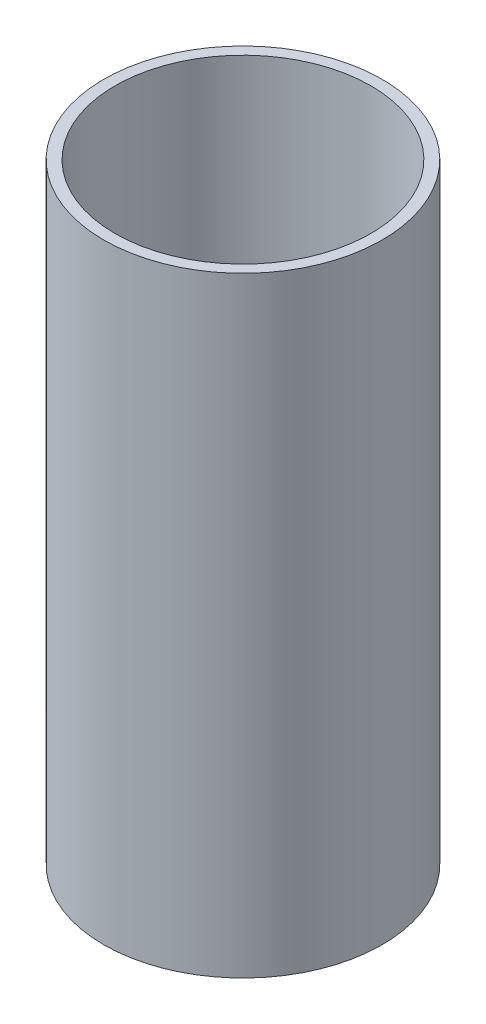
ISO-10303-21;
HEADER;
FILE_DESCRIPTION(('STEP AP214'),'2;1');
FILE_NAME('part.step','',(''),(''),'','','');
FILE_SCHEMA(('AUTOMOTIVE_DESIGN { 1 0 10303 214 1 1 1 1 }'));
ENDSEC;
DATA;
#1=APPLICATION_CONTEXT('core data for automotive mechanical design processes');
#2=APPLICATION_PROTOCOL_DEFINITION('international standard','automotive_design',2000,#1);
#3=PRODUCT_CONTEXT('',#1,'mechanical');
#4=PRODUCT('Part','Part','',(#3));
#5=PRODUCT_RELATED_PRODUCT_CATEGORY('part','',(#4));
#6=PRODUCT_DEFINITION_FORMATION('','',#4);
#7=PRODUCT_DEFINITION_CONTEXT('part definition',#1,'design');
#8=PRODUCT_DEFINITION('design','',#6,#7);
#9=PRODUCT_DEFINITION_SHAPE('','',#8);
#10=(LENGTH_UNIT() NAMED_UNIT(*) SI_UNIT(.MILLI.,.METRE.));
#11=(NAMED_UNIT(*) PLANE_ANGLE_UNIT() SI_UNIT($,.RADIAN.));
#12=(NAMED_UNIT(*) SI_UNIT($,.STERADIAN.) SOLID_ANGLE_UNIT());
#13=UNCERTAINTY_MEASURE_WITH_UNIT(LENGTH_MEASURE(1.E-05),#10,'distance_accuracy_value','');
#14=(GEOMETRIC_REPRESENTATION_CONTEXT(3) GLOBAL_UNCERTAINTY_ASSIGNED_CONTEXT((#13)) GLOBAL_UNIT_ASSIGNED_CONTEXT((#10,
#11,#12)) REPRESENTATION_CONTEXT('',''));
#15=CARTESIAN_POINT('',(0.,0.,0.));
#16=DIRECTION('',(0.,0.,1.));
#17=DIRECTION('',(1.,0.,0.));
#18=AXIS2_PLACEMENT_3D('',#15,#16,#17);
#19=CARTESIAN_POINT('',(-26.,30.2199119985306,0.));
#20=DIRECTION('',(0.,1.,0.));
#21=DIRECTION('',(0.,0.,1.));
#22=AXIS2_PLACEMENT_3D('',#19,#20,#21);
#23=PLANE('',#22);
#24=CARTESIAN_POINT('',(0.,30.2199119985306,0.));
#25=DIRECTION('',(0.,1.,0.));
#26=DIRECTION('',(0.,0.,1.));
#27=AXIS2_PLACEMENT_3D('',#24,#25,#26);
#28=CIRCLE('',#27,26.);
#29=CARTESIAN_POINT('',(0.,30.2199119985306,26.));
#30=VERTEX_POINT('',#29);
#31=EDGE_CURVE('E51',#30,#30,#28,.T.);
#32=ORIENTED_EDGE('',*,*,#31,.T.);
#33=EDGE_LOOP('',(#32));
#34=FACE_BOUND('',#33,.T.);
#35=CARTESIAN_POINT('',(0.,30.2199119985306,0.));
#36=DIRECTION('',(0.,1.,0.));
#37=DIRECTION('',(0.,0.,1.));
#38=AXIS2_PLACEMENT_3D('',#35,#36,#37);
#39=CIRCLE('',#38,23.9);
#40=CARTESIAN_POINT('',(0.,30.2199119985306,23.9));
#41=VERTEX_POINT('',#40);
#42=EDGE_CURVE('E10',#41,#41,#39,.T.);
#43=ORIENTED_EDGE('',*,*,#42,.F.);
#44=EDGE_LOOP('',(#43));
#45=FACE_BOUND('',#44,.T.);
#46=ADVANCED_FACE('F37',(#34,#45),#23,.T.);
#47=CARTESIAN_POINT('',(0.,30.2199119985306,0.));
#48=DIRECTION('',(0.,1.,0.));
#49=DIRECTION('',(0.,0.,1.));
#50=AXIS2_PLACEMENT_3D('',#47,#48,#49);
#51=CYLINDRICAL_SURFACE('',#50,23.9);
#52=ORIENTED_EDGE('',*,*,#42,.T.);
#53=EDGE_LOOP('',(#52));
#54=FACE_BOUND('',#53,.T.);
#55=CARTESIAN_POINT('',(0.,-83.7800880014694,0.));
#56=DIRECTION('',(0.,1.,0.));
#57=DIRECTION('',(0.,0.,1.));
#58=AXIS2_PLACEMENT_3D('',#55,#56,#57);
#59=CIRCLE('',#58,23.9);
#60=CARTESIAN_POINT('',(0.,-83.7800880014694,23.9));
#61=VERTEX_POINT('',#60);
#62=EDGE_CURVE('E43',#61,#61,#59,.T.);
#63=ORIENTED_EDGE('',*,*,#62,.F.);
#64=EDGE_LOOP('',(#63));
#65=FACE_BOUND('',#64,.T.);
#66=ADVANCED_FACE('F67',(#54,#65),#51,.F.);
#67=CARTESIAN_POINT('',(-26.,-83.7800880014694,0.));
#68=DIRECTION('',(0.,-1.,0.));
#69=DIRECTION('',(0.,0.,-1.));
#70=AXIS2_PLACEMENT_3D('',#67,#68,#69);
#71=PLANE('',#70);
#72=ORIENTED_EDGE('',*,*,#62,.T.);
#73=EDGE_LOOP('',(#72));
#74=FACE_BOUND('',#73,.T.);
#75=CARTESIAN_POINT('',(0.,-83.7800880014694,0.));
#76=DIRECTION('',(0.,1.,0.));
#77=DIRECTION('',(0.,0.,1.));
#78=AXIS2_PLACEMENT_3D('',#75,#76,#77);
#79=CIRCLE('',#78,26.);
#80=CARTESIAN_POINT('',(0.,-83.7800880014694,26.));
#81=VERTEX_POINT('',#80);
#82=EDGE_CURVE('E47',#81,#81,#79,.T.);
#83=ORIENTED_EDGE('',*,*,#82,.F.);
#84=EDGE_LOOP('',(#83));
#85=FACE_BOUND('',#84,.T.);
#86=ADVANCED_FACE('F61',(#74,#85),#71,.T.);
#87=CARTESIAN_POINT('',(0.,30.2199119985306,0.));
#88=DIRECTION('',(0.,1.,0.));
#89=DIRECTION('',(0.,0.,1.));
#90=AXIS2_PLACEMENT_3D('',#87,#88,#89);
#91=CYLINDRICAL_SURFACE('',#90,26.);
#92=ORIENTED_EDGE('',*,*,#82,.T.);
#93=EDGE_LOOP('',(#92));
#94=FACE_BOUND('',#93,.T.);
#95=ORIENTED_EDGE('',*,*,#31,.F.);
#96=EDGE_LOOP('',(#95));
#97=FACE_BOUND('',#96,.T.);
#98=ADVANCED_FACE('F59',(#94,#97),#91,.T.);
#99=CLOSED_SHELL('',(#46,#66,#86,#98));
#100=MANIFOLD_SOLID_BREP('B2',#99);
#101=ADVANCED_BREP_SHAPE_REPRESENTATION('',(#18,#100),#14);
#102=SHAPE_DEFINITION_REPRESENTATION(#9,#101);
ENDSEC;
END-ISO-10303-21;
